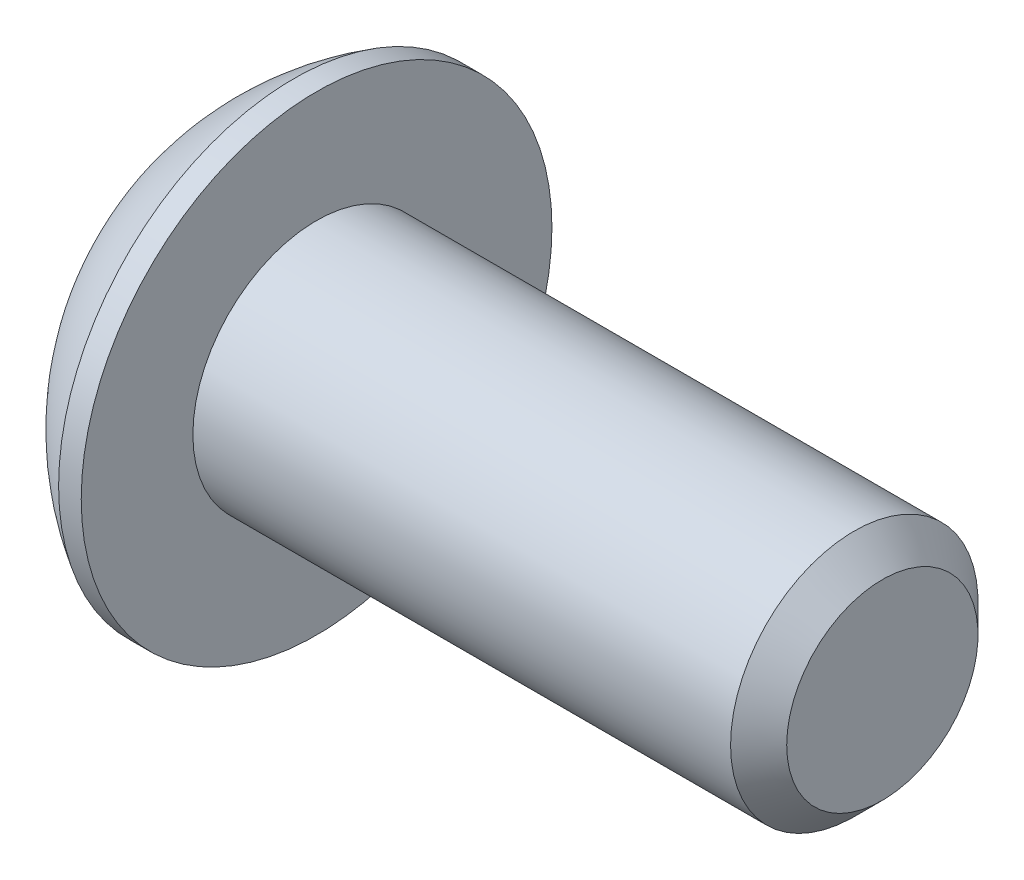
ISO-10303-21;
HEADER;
FILE_DESCRIPTION(('STEP AP214'),'2;1');
FILE_NAME('part.step','',(''),(''),'','','');
FILE_SCHEMA(('AUTOMOTIVE_DESIGN { 1 0 10303 214 1 1 1 1 }'));
ENDSEC;
DATA;
#1=APPLICATION_CONTEXT('core data for automotive mechanical design processes');
#2=APPLICATION_PROTOCOL_DEFINITION('international standard','automotive_design',2000,#1);
#3=PRODUCT_CONTEXT('',#1,'mechanical');
#4=PRODUCT('Part','Part','',(#3));
#5=PRODUCT_RELATED_PRODUCT_CATEGORY('part','',(#4));
#6=PRODUCT_DEFINITION_FORMATION('','',#4);
#7=PRODUCT_DEFINITION_CONTEXT('part definition',#1,'design');
#8=PRODUCT_DEFINITION('design','',#6,#7);
#9=PRODUCT_DEFINITION_SHAPE('','',#8);
#10=(LENGTH_UNIT() NAMED_UNIT(*) SI_UNIT(.MILLI.,.METRE.));
#11=(NAMED_UNIT(*) PLANE_ANGLE_UNIT() SI_UNIT($,.RADIAN.));
#12=(NAMED_UNIT(*) SI_UNIT($,.STERADIAN.) SOLID_ANGLE_UNIT());
#13=UNCERTAINTY_MEASURE_WITH_UNIT(LENGTH_MEASURE(1.E-05),#10,'distance_accuracy_value','');
#14=(GEOMETRIC_REPRESENTATION_CONTEXT(3) GLOBAL_UNCERTAINTY_ASSIGNED_CONTEXT((#13)) GLOBAL_UNIT_ASSIGNED_CONTEXT((#10,
#11,#12)) REPRESENTATION_CONTEXT('',''));
#15=CARTESIAN_POINT('',(0.,0.,0.));
#16=DIRECTION('',(0.,0.,1.));
#17=DIRECTION('',(1.,0.,0.));
#18=AXIS2_PLACEMENT_3D('',#15,#16,#17);
#19=CARTESIAN_POINT('',(1.32080000014412,0.,0.));
#20=DIRECTION('',(-1.,0.,0.));
#21=DIRECTION('',(0.,0.,1.));
#22=AXIS2_PLACEMENT_3D('',#19,#20,#21);
#23=CONICAL_SURFACE('',#22,1.19379999978264,1.04719755093309);
#24=CARTESIAN_POINT('',(2.01004075151445,0.,2.27373675443232E-10));
#25=VERTEX_POINT('',#24);
#26=VERTEX_LOOP('',#25);
#27=FACE_BOUND('',#26,.T.);
#28=CARTESIAN_POINT('',(1.32080000001284,0.,0.));
#29=DIRECTION('',(-1.,0.,0.));
#30=DIRECTION('',(0.,0.,1.));
#31=AXIS2_PLACEMENT_3D('',#28,#29,#30);
#32=CIRCLE('',#31,1.19380000001001);
#33=CARTESIAN_POINT('',(1.32080000000644,-1.0338611270422,0.596900000002507));
#34=VERTEX_POINT('',#33);
#35=CARTESIAN_POINT('',(1.32080000000644,0.,1.19380000000501));
#36=VERTEX_POINT('',#35);
#37=EDGE_CURVE('E92',#34,#36,#32,.T.);
#38=ORIENTED_EDGE('',*,*,#37,.T.);
#39=CARTESIAN_POINT('',(1.32080000001284,0.,0.));
#40=DIRECTION('',(-1.,0.,0.));
#41=DIRECTION('',(0.,0.,1.));
#42=AXIS2_PLACEMENT_3D('',#39,#40,#41);
#43=CIRCLE('',#42,1.19380000001001);
#44=CARTESIAN_POINT('',(1.32080000000644,1.0338611270422,0.596900000002507));
#45=VERTEX_POINT('',#44);
#46=EDGE_CURVE('E88',#36,#45,#43,.T.);
#47=ORIENTED_EDGE('',*,*,#46,.T.);
#48=CARTESIAN_POINT('',(1.32080000001284,0.,0.));
#49=DIRECTION('',(-1.,0.,0.));
#50=DIRECTION('',(0.,0.,1.));
#51=AXIS2_PLACEMENT_3D('',#48,#49,#50);
#52=CIRCLE('',#51,1.19380000001001);
#53=CARTESIAN_POINT('',(1.32080000000644,1.0338611270422,-0.596900000002503));
#54=VERTEX_POINT('',#53);
#55=EDGE_CURVE('E21',#45,#54,#52,.T.);
#56=ORIENTED_EDGE('',*,*,#55,.T.);
#57=CARTESIAN_POINT('',(1.32080000001284,0.,0.));
#58=DIRECTION('',(-1.,0.,0.));
#59=DIRECTION('',(0.,0.,1.));
#60=AXIS2_PLACEMENT_3D('',#57,#58,#59);
#61=CIRCLE('',#60,1.19380000001001);
#62=CARTESIAN_POINT('',(1.32080000000644,1.49193044797401E-12,-1.193800000005));
#63=VERTEX_POINT('',#62);
#64=EDGE_CURVE('E151',#54,#63,#61,.T.);
#65=ORIENTED_EDGE('',*,*,#64,.T.);
#66=CARTESIAN_POINT('',(1.32080000001284,0.,0.));
#67=DIRECTION('',(-1.,0.,0.));
#68=DIRECTION('',(0.,0.,1.));
#69=AXIS2_PLACEMENT_3D('',#66,#67,#68);
#70=CIRCLE('',#69,1.19380000001001);
#71=CARTESIAN_POINT('',(1.32080000000644,-1.03386112704219,-0.596900000002507));
#72=VERTEX_POINT('',#71);
#73=EDGE_CURVE('E153',#63,#72,#70,.T.);
#74=ORIENTED_EDGE('',*,*,#73,.T.);
#75=CARTESIAN_POINT('',(1.32080000001284,0.,0.));
#76=DIRECTION('',(-1.,0.,0.));
#77=DIRECTION('',(0.,0.,1.));
#78=AXIS2_PLACEMENT_3D('',#75,#76,#77);
#79=CIRCLE('',#78,1.19380000001001);
#80=EDGE_CURVE('E155',#72,#34,#79,.T.);
#81=ORIENTED_EDGE('',*,*,#80,.T.);
#82=EDGE_LOOP('',(#38,#47,#56,#65,#74,#81));
#83=FACE_BOUND('',#82,.T.);
#84=ADVANCED_FACE('F17',(#27,#83),#23,.F.);
#85=CARTESIAN_POINT('',(1.32080000000001,-2.06772225407572,-1.19379999999998));
#86=DIRECTION('',(1.,0.,0.));
#87=DIRECTION('',(0.,0.,-1.));
#88=AXIS2_PLACEMENT_3D('',#85,#86,#87);
#89=PLANE('',#88);
#90=DIRECTION('',(0.,-0.5,-0.866025403784439));
#91=VECTOR('',#90,1.);
#92=CARTESIAN_POINT('',(1.32080000000004,1.37848150271715,0.));
#93=LINE('',#92,#91);
#94=CARTESIAN_POINT('',(1.32080000000002,1.37848150271715,0.));
#95=VERTEX_POINT('',#94);
#96=EDGE_CURVE('E104',#54,#95,#93,.F.);
#97=ORIENTED_EDGE('',*,*,#96,.F.);
#98=ORIENTED_EDGE('',*,*,#55,.F.);
#99=DIRECTION('',(0.,0.5,-0.866025403784439));
#100=VECTOR('',#99,1.);
#101=CARTESIAN_POINT('',(1.32080000000001,0.689240751358577,1.1938));
#102=LINE('',#101,#100);
#103=EDGE_CURVE('E102',#95,#45,#102,.F.);
#104=ORIENTED_EDGE('',*,*,#103,.F.);
#105=EDGE_LOOP('',(#97,#98,#104));
#106=FACE_BOUND('',#105,.T.);
#107=ADVANCED_FACE('F100',(#106),#89,.F.);
#108=CARTESIAN_POINT('',(1.32080000000001,-2.06772225407572,-1.19379999999998));
#109=DIRECTION('',(1.,0.,0.));
#110=DIRECTION('',(0.,0.,-1.));
#111=AXIS2_PLACEMENT_3D('',#108,#109,#110);
#112=PLANE('',#111);
#113=DIRECTION('',(0.,0.5,-0.866025403784439));
#114=VECTOR('',#113,1.);
#115=CARTESIAN_POINT('',(1.32080000000004,0.689240751358577,1.1938));
#116=LINE('',#115,#114);
#117=CARTESIAN_POINT('',(1.32080000000002,0.689240751358577,1.1938));
#118=VERTEX_POINT('',#117);
#119=EDGE_CURVE('E106',#45,#118,#116,.F.);
#120=ORIENTED_EDGE('',*,*,#119,.F.);
#121=ORIENTED_EDGE('',*,*,#46,.F.);
#122=DIRECTION('',(0.,1.,0.));
#123=VECTOR('',#122,1.);
#124=CARTESIAN_POINT('',(1.32080000000001,-0.689240751358573,1.19380000000001));
#125=LINE('',#124,#123);
#126=EDGE_CURVE('E109',#118,#36,#125,.F.);
#127=ORIENTED_EDGE('',*,*,#126,.F.);
#128=EDGE_LOOP('',(#120,#121,#127));
#129=FACE_BOUND('',#128,.T.);
#130=ADVANCED_FACE('F107',(#129),#112,.F.);
#131=CARTESIAN_POINT('',(1.32080000000001,-2.06772225407572,-1.19379999999998));
#132=DIRECTION('',(1.,0.,0.));
#133=DIRECTION('',(0.,0.,-1.));
#134=AXIS2_PLACEMENT_3D('',#131,#132,#133);
#135=PLANE('',#134);
#136=DIRECTION('',(0.,1.,0.));
#137=VECTOR('',#136,1.);
#138=CARTESIAN_POINT('',(1.32080000000004,-0.689240751358573,1.19380000000001));
#139=LINE('',#138,#137);
#140=CARTESIAN_POINT('',(1.32080000000002,-0.689240751358577,1.19380000000001));
#141=VERTEX_POINT('',#140);
#142=EDGE_CURVE('E169',#36,#141,#139,.F.);
#143=ORIENTED_EDGE('',*,*,#142,.F.);
#144=ORIENTED_EDGE('',*,*,#37,.F.);
#145=DIRECTION('',(0.,0.5,0.866025403784439));
#146=VECTOR('',#145,1.);
#147=CARTESIAN_POINT('',(1.32080000000001,-1.37848150271715,0.));
#148=LINE('',#147,#146);
#149=EDGE_CURVE('E167',#141,#34,#148,.F.);
#150=ORIENTED_EDGE('',*,*,#149,.F.);
#151=EDGE_LOOP('',(#143,#144,#150));
#152=FACE_BOUND('',#151,.T.);
#153=ADVANCED_FACE('F165',(#152),#135,.F.);
#154=CARTESIAN_POINT('',(1.32080000000001,-2.06772225407572,-1.19379999999998));
#155=DIRECTION('',(1.,0.,0.));
#156=DIRECTION('',(0.,0.,-1.));
#157=AXIS2_PLACEMENT_3D('',#154,#155,#156);
#158=PLANE('',#157);
#159=DIRECTION('',(0.,0.5,0.866025403784439));
#160=VECTOR('',#159,1.);
#161=CARTESIAN_POINT('',(1.32080000000004,-1.37848150271715,0.));
#162=LINE('',#161,#160);
#163=CARTESIAN_POINT('',(1.32080000000002,-1.37848150271715,0.));
#164=VERTEX_POINT('',#163);
#165=EDGE_CURVE('E170',#34,#164,#162,.F.);
#166=ORIENTED_EDGE('',*,*,#165,.F.);
#167=ORIENTED_EDGE('',*,*,#80,.F.);
#168=DIRECTION('',(0.,-0.5,0.866025403784439));
#169=VECTOR('',#168,1.);
#170=CARTESIAN_POINT('',(1.32080000000001,-0.689240751358573,-1.19379999999999));
#171=LINE('',#170,#169);
#172=EDGE_CURVE('E173',#164,#72,#171,.F.);
#173=ORIENTED_EDGE('',*,*,#172,.F.);
#174=EDGE_LOOP('',(#166,#167,#173));
#175=FACE_BOUND('',#174,.T.);
#176=ADVANCED_FACE('F171',(#175),#158,.F.);
#177=CARTESIAN_POINT('',(1.32080000000001,-2.06772225407572,-1.19379999999998));
#178=DIRECTION('',(1.,0.,0.));
#179=DIRECTION('',(0.,0.,-1.));
#180=AXIS2_PLACEMENT_3D('',#177,#178,#179);
#181=PLANE('',#180);
#182=DIRECTION('',(0.,-0.5,0.866025403784439));
#183=VECTOR('',#182,1.);
#184=CARTESIAN_POINT('',(1.32080000000004,-0.689240751358573,-1.19379999999999));
#185=LINE('',#184,#183);
#186=CARTESIAN_POINT('',(1.32080000000002,-0.689240751358573,-1.19379999999999));
#187=VERTEX_POINT('',#186);
#188=EDGE_CURVE('E228',#72,#187,#185,.F.);
#189=ORIENTED_EDGE('',*,*,#188,.F.);
#190=ORIENTED_EDGE('',*,*,#73,.F.);
#191=DIRECTION('',(0.,1.,0.));
#192=VECTOR('',#191,1.);
#193=CARTESIAN_POINT('',(1.32080000000001,0.689240751358577,-1.19379999999999));
#194=LINE('',#193,#192);
#195=EDGE_CURVE('E240',#187,#63,#194,.T.);
#196=ORIENTED_EDGE('',*,*,#195,.F.);
#197=EDGE_LOOP('',(#189,#190,#196));
#198=FACE_BOUND('',#197,.T.);
#199=ADVANCED_FACE('F390',(#198),#181,.F.);
#200=CARTESIAN_POINT('',(1.32080000000001,-2.06772225407572,-1.19379999999998));
#201=DIRECTION('',(1.,0.,0.));
#202=DIRECTION('',(0.,0.,-1.));
#203=AXIS2_PLACEMENT_3D('',#200,#201,#202);
#204=PLANE('',#203);
#205=DIRECTION('',(0.,1.,0.));
#206=VECTOR('',#205,1.);
#207=CARTESIAN_POINT('',(1.32080000000004,0.689240751358577,-1.19379999999999));
#208=LINE('',#207,#206);
#209=CARTESIAN_POINT('',(1.32080000000002,0.689240751358564,-1.19380000000002));
#210=VERTEX_POINT('',#209);
#211=EDGE_CURVE('E248',#63,#210,#208,.T.);
#212=ORIENTED_EDGE('',*,*,#211,.F.);
#213=ORIENTED_EDGE('',*,*,#64,.F.);
#214=DIRECTION('',(0.,-0.5,-0.866025403784439));
#215=VECTOR('',#214,1.);
#216=CARTESIAN_POINT('',(1.32080000000001,1.37848150271715,0.));
#217=LINE('',#216,#215);
#218=EDGE_CURVE('E128',#210,#54,#217,.F.);
#219=ORIENTED_EDGE('',*,*,#218,.F.);
#220=EDGE_LOOP('',(#212,#213,#219));
#221=FACE_BOUND('',#220,.T.);
#222=ADVANCED_FACE('F380',(#221),#204,.F.);
#223=CARTESIAN_POINT('',(1.32080000000001,1.37848150271715,0.));
#224=DIRECTION('',(0.,-0.866025403784439,0.5));
#225=DIRECTION('',(0.,-0.5,-0.866025403784439));
#226=AXIS2_PLACEMENT_3D('',#223,#224,#225);
#227=PLANE('',#226);
#228=ORIENTED_EDGE('',*,*,#96,.T.);
#229=DIRECTION('',(1.,0.,0.));
#230=VECTOR('',#229,1.);
#231=CARTESIAN_POINT('',(1.32080000000001,1.37848150271715,0.));
#232=LINE('',#231,#230);
#233=CARTESIAN_POINT('',(0.,1.37848150271715,0.));
#234=VERTEX_POINT('',#233);
#235=EDGE_CURVE('E116',#234,#95,#232,.T.);
#236=ORIENTED_EDGE('',*,*,#235,.F.);
#237=DIRECTION('',(0.,0.499999999999998,0.86602540378444));
#238=VECTOR('',#237,1.);
#239=CARTESIAN_POINT('',(0.,0.689240751358577,-1.1938));
#240=LINE('',#239,#238);
#241=CARTESIAN_POINT('',(0.,0.689240751358577,-1.1938));
#242=VERTEX_POINT('',#241);
#243=EDGE_CURVE('E131',#242,#234,#240,.T.);
#244=ORIENTED_EDGE('',*,*,#243,.F.);
#245=DIRECTION('',(1.,0.,0.));
#246=VECTOR('',#245,1.);
#247=CARTESIAN_POINT('',(1.32080000000001,0.689240751358577,-1.19379999999999));
#248=LINE('',#247,#246);
#249=EDGE_CURVE('E135',#210,#242,#248,.F.);
#250=ORIENTED_EDGE('',*,*,#249,.F.);
#251=ORIENTED_EDGE('',*,*,#218,.T.);
#252=EDGE_LOOP('',(#228,#236,#244,#250,#251));
#253=FACE_BOUND('',#252,.T.);
#254=ADVANCED_FACE('F371',(#253),#227,.T.);
#255=CARTESIAN_POINT('',(1.32080000000001,0.689240751358577,1.1938));
#256=DIRECTION('',(0.,-0.866025403784439,-0.5));
#257=DIRECTION('',(0.,0.5,-0.866025403784439));
#258=AXIS2_PLACEMENT_3D('',#255,#256,#257);
#259=PLANE('',#258);
#260=ORIENTED_EDGE('',*,*,#119,.T.);
#261=DIRECTION('',(1.,0.,0.));
#262=VECTOR('',#261,1.);
#263=CARTESIAN_POINT('',(1.32080000000001,0.689240751358577,1.19380000000001));
#264=LINE('',#263,#262);
#265=CARTESIAN_POINT('',(0.,0.689240751358577,1.1938));
#266=VERTEX_POINT('',#265);
#267=EDGE_CURVE('E112',#266,#118,#264,.T.);
#268=ORIENTED_EDGE('',*,*,#267,.F.);
#269=DIRECTION('',(0.,-0.500000000000004,0.866025403784437));
#270=VECTOR('',#269,1.);
#271=CARTESIAN_POINT('',(0.,1.37848150271715,0.));
#272=LINE('',#271,#270);
#273=EDGE_CURVE('E134',#234,#266,#272,.T.);
#274=ORIENTED_EDGE('',*,*,#273,.F.);
#275=ORIENTED_EDGE('',*,*,#235,.T.);
#276=ORIENTED_EDGE('',*,*,#103,.T.);
#277=EDGE_LOOP('',(#260,#268,#274,#275,#276));
#278=FACE_BOUND('',#277,.T.);
#279=ADVANCED_FACE('F114',(#278),#259,.T.);
#280=CARTESIAN_POINT('',(1.32080000000001,-0.689240751358573,1.19380000000001));
#281=DIRECTION('',(0.,0.,-1.));
#282=DIRECTION('',(0.,1.,0.));
#283=AXIS2_PLACEMENT_3D('',#280,#281,#282);
#284=PLANE('',#283);
#285=ORIENTED_EDGE('',*,*,#142,.T.);
#286=DIRECTION('',(1.,0.,0.));
#287=VECTOR('',#286,1.);
#288=CARTESIAN_POINT('',(1.32080000000001,-0.689240751358579,1.19380000000001));
#289=LINE('',#288,#287);
#290=CARTESIAN_POINT('',(0.,-0.689240751358577,1.19380000000001));
#291=VERTEX_POINT('',#290);
#292=EDGE_CURVE('E180',#291,#141,#289,.T.);
#293=ORIENTED_EDGE('',*,*,#292,.F.);
#294=DIRECTION('',(0.,1.,0.));
#295=VECTOR('',#294,1.);
#296=CARTESIAN_POINT('',(0.,0.,1.1938));
#297=LINE('',#296,#295);
#298=EDGE_CURVE('E194',#266,#291,#297,.F.);
#299=ORIENTED_EDGE('',*,*,#298,.F.);
#300=ORIENTED_EDGE('',*,*,#267,.T.);
#301=ORIENTED_EDGE('',*,*,#126,.T.);
#302=EDGE_LOOP('',(#285,#293,#299,#300,#301));
#303=FACE_BOUND('',#302,.T.);
#304=ADVANCED_FACE('F216',(#303),#284,.T.);
#305=CARTESIAN_POINT('',(1.32080000000001,-1.37848150271715,0.));
#306=DIRECTION('',(0.,0.866025403784439,-0.5));
#307=DIRECTION('',(0.,0.5,0.866025403784439));
#308=AXIS2_PLACEMENT_3D('',#305,#306,#307);
#309=PLANE('',#308);
#310=ORIENTED_EDGE('',*,*,#165,.T.);
#311=DIRECTION('',(1.,0.,0.));
#312=VECTOR('',#311,1.);
#313=CARTESIAN_POINT('',(1.32080000000001,-1.37848150271715,0.));
#314=LINE('',#313,#312);
#315=CARTESIAN_POINT('',(0.,-1.37848150271715,0.));
#316=VERTEX_POINT('',#315);
#317=EDGE_CURVE('E176',#316,#164,#314,.T.);
#318=ORIENTED_EDGE('',*,*,#317,.F.);
#319=DIRECTION('',(0.,-0.499999999999999,-0.866025403784439));
#320=VECTOR('',#319,1.);
#321=CARTESIAN_POINT('',(0.,-0.689240751358573,1.19380000000001));
#322=LINE('',#321,#320);
#323=EDGE_CURVE('E197',#291,#316,#322,.T.);
#324=ORIENTED_EDGE('',*,*,#323,.F.);
#325=ORIENTED_EDGE('',*,*,#292,.T.);
#326=ORIENTED_EDGE('',*,*,#149,.T.);
#327=EDGE_LOOP('',(#310,#318,#324,#325,#326));
#328=FACE_BOUND('',#327,.T.);
#329=ADVANCED_FACE('F178',(#328),#309,.T.);
#330=CARTESIAN_POINT('',(1.32080000000001,-0.689240751358573,-1.19379999999999));
#331=DIRECTION('',(0.,0.866025403784439,0.5));
#332=DIRECTION('',(0.,-0.5,0.866025403784439));
#333=AXIS2_PLACEMENT_3D('',#330,#331,#332);
#334=PLANE('',#333);
#335=ORIENTED_EDGE('',*,*,#188,.T.);
#336=DIRECTION('',(1.,0.,0.));
#337=VECTOR('',#336,1.);
#338=CARTESIAN_POINT('',(1.32080000000001,-0.689240751358573,-1.19379999999999));
#339=LINE('',#338,#337);
#340=CARTESIAN_POINT('',(0.,-0.689240751358573,-1.19379999999999));
#341=VERTEX_POINT('',#340);
#342=EDGE_CURVE('E36',#341,#187,#339,.T.);
#343=ORIENTED_EDGE('',*,*,#342,.F.);
#344=DIRECTION('',(0.,0.499999999999998,-0.86602540378444));
#345=VECTOR('',#344,1.);
#346=CARTESIAN_POINT('',(0.,-1.37848150271715,0.));
#347=LINE('',#346,#345);
#348=EDGE_CURVE('E217',#316,#341,#347,.T.);
#349=ORIENTED_EDGE('',*,*,#348,.F.);
#350=ORIENTED_EDGE('',*,*,#317,.T.);
#351=ORIENTED_EDGE('',*,*,#172,.T.);
#352=EDGE_LOOP('',(#335,#343,#349,#350,#351));
#353=FACE_BOUND('',#352,.T.);
#354=ADVANCED_FACE('F337',(#353),#334,.T.);
#355=CARTESIAN_POINT('',(1.32080000000001,0.689240751358577,-1.19379999999999));
#356=DIRECTION('',(0.,0.,1.));
#357=DIRECTION('',(1.,0.,0.));
#358=AXIS2_PLACEMENT_3D('',#355,#356,#357);
#359=PLANE('',#358);
#360=ORIENTED_EDGE('',*,*,#211,.T.);
#361=ORIENTED_EDGE('',*,*,#249,.T.);
#362=DIRECTION('',(0.,1.,0.));
#363=VECTOR('',#362,1.);
#364=CARTESIAN_POINT('',(0.,0.,-1.19379999999999));
#365=LINE('',#364,#363);
#366=EDGE_CURVE('E150',#341,#242,#365,.T.);
#367=ORIENTED_EDGE('',*,*,#366,.F.);
#368=ORIENTED_EDGE('',*,*,#342,.T.);
#369=ORIENTED_EDGE('',*,*,#195,.T.);
#370=EDGE_LOOP('',(#360,#361,#367,#368,#369));
#371=FACE_BOUND('',#370,.T.);
#372=ADVANCED_FACE('F328',(#371),#359,.T.);
#373=CARTESIAN_POINT('',(0.,0.,0.));
#374=DIRECTION('',(-1.,0.,0.));
#375=DIRECTION('',(0.,0.,1.));
#376=AXIS2_PLACEMENT_3D('',#373,#374,#375);
#377=PLANE('',#376);
#378=CARTESIAN_POINT('',(0.,0.,0.));
#379=DIRECTION('',(-1.,0.,0.));
#380=DIRECTION('',(0.,0.,1.));
#381=AXIS2_PLACEMENT_3D('',#378,#379,#380);
#382=CIRCLE('',#381,1.98120000000003);
#383=CARTESIAN_POINT('',(0.,0.,1.98120000000004));
#384=VERTEX_POINT('',#383);
#385=EDGE_CURVE('E147',#384,#384,#382,.F.);
#386=ORIENTED_EDGE('',*,*,#385,.F.);
#387=EDGE_LOOP('',(#386));
#388=FACE_BOUND('',#387,.T.);
#389=ORIENTED_EDGE('',*,*,#348,.T.);
#390=ORIENTED_EDGE('',*,*,#366,.T.);
#391=ORIENTED_EDGE('',*,*,#243,.T.);
#392=ORIENTED_EDGE('',*,*,#273,.T.);
#393=ORIENTED_EDGE('',*,*,#298,.T.);
#394=ORIENTED_EDGE('',*,*,#323,.T.);
#395=EDGE_LOOP('',(#389,#390,#391,#392,#393,#394));
#396=FACE_BOUND('',#395,.T.);
#397=ADVANCED_FACE('F210',(#388,#396),#377,.T.);
#398=CARTESIAN_POINT('',(4.13384999999999,0.,0.));
#399=DIRECTION('',(0.,1.,0.));
#400=DIRECTION('',(-0.48966740395494,0.,-0.87190930348519));
#401=AXIS2_PLACEMENT_3D('',#398,#399,#400);
#402=SPHERICAL_SURFACE('',#401,4.5840887057844);
#403=CARTESIAN_POINT('',(4.13384999999999,0.,0.));
#404=DIRECTION('',(-1.,0.,0.));
#405=DIRECTION('',(0.,0.,1.));
#406=AXIS2_PLACEMENT_3D('',#403,#404,#405);
#407=SPHERICAL_SURFACE('',#406,4.5840887057844);
#408=ORIENTED_EDGE('',*,*,#385,.T.);
#409=EDGE_LOOP('',(#408));
#410=FACE_BOUND('',#409,.T.);
#411=CARTESIAN_POINT('',(1.82879999999999,0.,0.));
#412=DIRECTION('',(-1.,0.,0.));
#413=DIRECTION('',(0.,0.,1.));
#414=AXIS2_PLACEMENT_3D('',#411,#412,#413);
#415=CIRCLE('',#414,3.9624);
#416=CARTESIAN_POINT('',(1.82879999999999,0.,3.9624));
#417=VERTEX_POINT('',#416);
#418=EDGE_CURVE('E144',#417,#417,#415,.F.);
#419=ORIENTED_EDGE('',*,*,#418,.F.);
#420=EDGE_LOOP('',(#419));
#421=FACE_BOUND('',#420,.T.);
#422=ADVANCED_FACE('F19',(#410,#421),#407,.T.);
#423=CARTESIAN_POINT('',(11.7348,0.,0.));
#424=DIRECTION('',(-1.,0.,0.));
#425=DIRECTION('',(0.,0.,1.));
#426=AXIS2_PLACEMENT_3D('',#423,#424,#425);
#427=PLANE('',#426);
#428=CARTESIAN_POINT('',(11.7347999998856,0.,0.));
#429=DIRECTION('',(-1.,0.,0.));
#430=DIRECTION('',(0.,0.,1.));
#431=AXIS2_PLACEMENT_3D('',#428,#429,#430);
#432=CIRCLE('',#431,1.61036000008608);
#433=CARTESIAN_POINT('',(11.7347999998856,0.,1.61036000008608));
#434=VERTEX_POINT('',#433);
#435=EDGE_CURVE('E141',#434,#434,#432,.T.);
#436=ORIENTED_EDGE('',*,*,#435,.F.);
#437=EDGE_LOOP('',(#436));
#438=FACE_BOUND('',#437,.T.);
#439=ADVANCED_FACE('F270',(#438),#427,.F.);
#440=CARTESIAN_POINT('',(0.,0.,0.));
#441=DIRECTION('',(-1.,0.,0.));
#442=DIRECTION('',(0.,0.,1.));
#443=AXIS2_PLACEMENT_3D('',#440,#441,#442);
#444=CYLINDRICAL_SURFACE('',#443,3.9624);
#445=ORIENTED_EDGE('',*,*,#418,.T.);
#446=EDGE_LOOP('',(#445));
#447=FACE_BOUND('',#446,.T.);
#448=CARTESIAN_POINT('',(2.20980000000001,0.,0.));
#449=DIRECTION('',(-1.,0.,0.));
#450=DIRECTION('',(0.,0.,1.));
#451=AXIS2_PLACEMENT_3D('',#448,#449,#450);
#452=CIRCLE('',#451,3.9624);
#453=CARTESIAN_POINT('',(2.20980000000001,0.,3.9624));
#454=VERTEX_POINT('',#453);
#455=EDGE_CURVE('E138',#454,#454,#452,.T.);
#456=ORIENTED_EDGE('',*,*,#455,.T.);
#457=EDGE_LOOP('',(#456));
#458=FACE_BOUND('',#457,.T.);
#459=ADVANCED_FACE('F266',(#447,#458),#444,.T.);
#460=CARTESIAN_POINT('',(11.2623600000461,0.,0.));
#461=DIRECTION('',(-1.,0.,0.));
#462=DIRECTION('',(0.,0.,1.));
#463=AXIS2_PLACEMENT_3D('',#460,#461,#462);
#464=CONICAL_SURFACE('',#463,2.08279999992556,0.785398163397448);
#465=CARTESIAN_POINT('',(11.26236,0.,0.));
#466=DIRECTION('',(-1.,0.,0.));
#467=DIRECTION('',(0.,0.,1.));
#468=AXIS2_PLACEMENT_3D('',#465,#466,#467);
#469=CIRCLE('',#468,2.0828);
#470=CARTESIAN_POINT('',(11.26236,0.,2.0828));
#471=VERTEX_POINT('',#470);
#472=EDGE_CURVE('E27',#471,#471,#469,.T.);
#473=ORIENTED_EDGE('',*,*,#472,.F.);
#474=EDGE_LOOP('',(#473));
#475=FACE_BOUND('',#474,.T.);
#476=ORIENTED_EDGE('',*,*,#435,.T.);
#477=EDGE_LOOP('',(#476));
#478=FACE_BOUND('',#477,.T.);
#479=ADVANCED_FACE('F262',(#475,#478),#464,.T.);
#480=CARTESIAN_POINT('',(2.20980000000001,2.0828,0.));
#481=DIRECTION('',(-1.,0.,0.));
#482=DIRECTION('',(0.,0.,1.));
#483=AXIS2_PLACEMENT_3D('',#480,#481,#482);
#484=PLANE('',#483);
#485=ORIENTED_EDGE('',*,*,#455,.F.);
#486=EDGE_LOOP('',(#485));
#487=FACE_BOUND('',#486,.T.);
#488=CARTESIAN_POINT('',(2.20980000000001,0.,0.));
#489=DIRECTION('',(-1.,0.,0.));
#490=DIRECTION('',(0.,0.,1.));
#491=AXIS2_PLACEMENT_3D('',#488,#489,#490);
#492=CIRCLE('',#491,2.0828);
#493=CARTESIAN_POINT('',(2.20980000000001,0.,2.0828));
#494=VERTEX_POINT('',#493);
#495=EDGE_CURVE('E11',#494,#494,#492,.F.);
#496=ORIENTED_EDGE('',*,*,#495,.F.);
#497=EDGE_LOOP('',(#496));
#498=FACE_BOUND('',#497,.T.);
#499=ADVANCED_FACE('F265',(#487,#498),#484,.F.);
#500=CARTESIAN_POINT('',(0.,0.,0.));
#501=DIRECTION('',(-1.,0.,0.));
#502=DIRECTION('',(0.,0.,1.));
#503=AXIS2_PLACEMENT_3D('',#500,#501,#502);
#504=CYLINDRICAL_SURFACE('',#503,2.0828);
#505=ORIENTED_EDGE('',*,*,#495,.T.);
#506=EDGE_LOOP('',(#505));
#507=FACE_BOUND('',#506,.T.);
#508=ORIENTED_EDGE('',*,*,#472,.T.);
#509=EDGE_LOOP('',(#508));
#510=FACE_BOUND('',#509,.T.);
#511=ADVANCED_FACE('F260',(#507,#510),#504,.T.);
#512=CLOSED_SHELL('',(#84,#107,#130,#153,#176,#199,#222,#254,#279,#304,#329,#354,#372,#397,#422,
#439,#459,#479,#499,#511));
#513=MANIFOLD_SOLID_BREP('B1',#512);
#514=ADVANCED_BREP_SHAPE_REPRESENTATION('',(#18,#513),#14);
#515=SHAPE_DEFINITION_REPRESENTATION(#9,#514);
ENDSEC;
END-ISO-10303-21;
